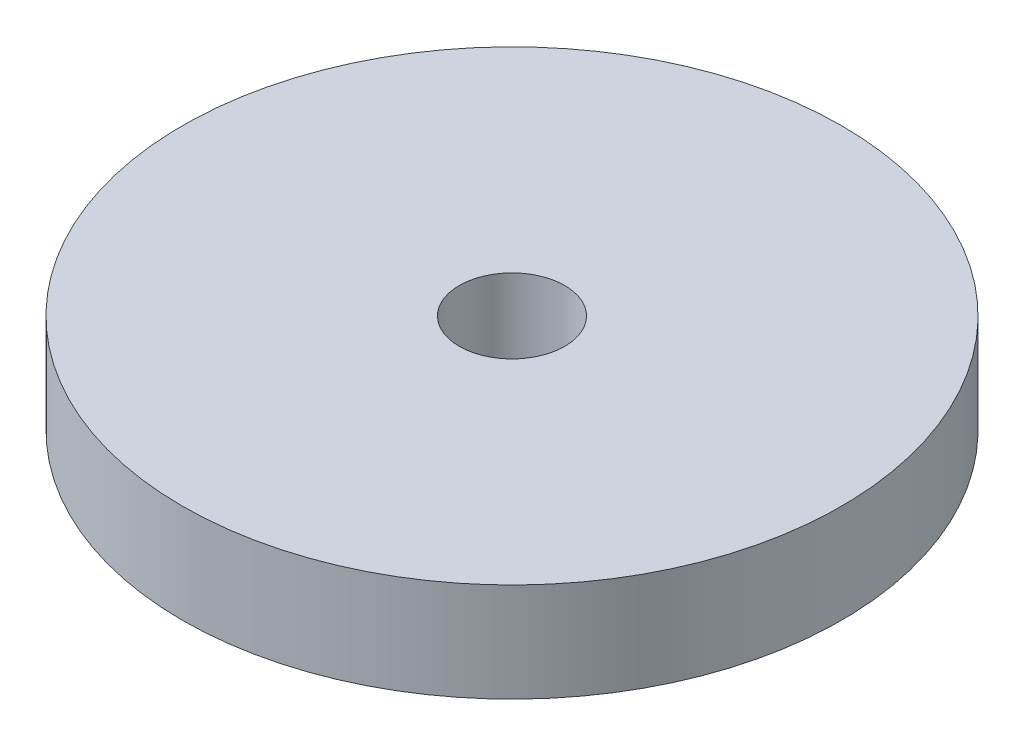
ISO-10303-21;
HEADER;
FILE_DESCRIPTION(('STEP AP214'),'2;1');
FILE_NAME('part.step','',(''),(''),'','','');
FILE_SCHEMA(('AUTOMOTIVE_DESIGN { 1 0 10303 214 1 1 1 1 }'));
ENDSEC;
DATA;
#1=APPLICATION_CONTEXT('core data for automotive mechanical design processes');
#2=APPLICATION_PROTOCOL_DEFINITION('international standard','automotive_design',2000,#1);
#3=PRODUCT_CONTEXT('',#1,'mechanical');
#4=PRODUCT('Part','Part','',(#3));
#5=PRODUCT_RELATED_PRODUCT_CATEGORY('part','',(#4));
#6=PRODUCT_DEFINITION_FORMATION('','',#4);
#7=PRODUCT_DEFINITION_CONTEXT('part definition',#1,'design');
#8=PRODUCT_DEFINITION('design','',#6,#7);
#9=PRODUCT_DEFINITION_SHAPE('','',#8);
#10=(LENGTH_UNIT() NAMED_UNIT(*) SI_UNIT(.MILLI.,.METRE.));
#11=(NAMED_UNIT(*) PLANE_ANGLE_UNIT() SI_UNIT($,.RADIAN.));
#12=(NAMED_UNIT(*) SI_UNIT($,.STERADIAN.) SOLID_ANGLE_UNIT());
#13=UNCERTAINTY_MEASURE_WITH_UNIT(LENGTH_MEASURE(1.E-05),#10,'distance_accuracy_value','');
#14=(GEOMETRIC_REPRESENTATION_CONTEXT(3) GLOBAL_UNCERTAINTY_ASSIGNED_CONTEXT((#13)) GLOBAL_UNIT_ASSIGNED_CONTEXT((#10,
#11,#12)) REPRESENTATION_CONTEXT('',''));
#15=CARTESIAN_POINT('',(0.,0.,0.));
#16=DIRECTION('',(0.,0.,1.));
#17=DIRECTION('',(1.,0.,0.));
#18=AXIS2_PLACEMENT_3D('',#15,#16,#17);
#19=CARTESIAN_POINT('',(0.,3.,0.));
#20=DIRECTION('',(0.,1.,0.));
#21=DIRECTION('',(0.,0.,1.));
#22=AXIS2_PLACEMENT_3D('',#19,#20,#21);
#23=PLANE('',#22);
#24=CARTESIAN_POINT('',(0.,3.,0.));
#25=DIRECTION('',(0.,1.,0.));
#26=DIRECTION('',(0.,0.,1.));
#27=AXIS2_PLACEMENT_3D('',#24,#25,#26);
#28=CIRCLE('',#27,10.);
#29=CARTESIAN_POINT('',(0.,3.,10.));
#30=VERTEX_POINT('',#29);
#31=EDGE_CURVE('E10',#30,#30,#28,.T.);
#32=ORIENTED_EDGE('',*,*,#31,.T.);
#33=EDGE_LOOP('',(#32));
#34=FACE_BOUND('',#33,.T.);
#35=CARTESIAN_POINT('',(0.,3.,0.));
#36=DIRECTION('',(0.,1.,0.));
#37=DIRECTION('',(0.,0.,1.));
#38=AXIS2_PLACEMENT_3D('',#35,#36,#37);
#39=CIRCLE('',#38,1.6);
#40=CARTESIAN_POINT('',(0.,3.,1.6));
#41=VERTEX_POINT('',#40);
#42=EDGE_CURVE('E56',#41,#41,#39,.T.);
#43=ORIENTED_EDGE('',*,*,#42,.F.);
#44=EDGE_LOOP('',(#43));
#45=FACE_BOUND('',#44,.T.);
#46=ADVANCED_FACE('F43',(#34,#45),#23,.T.);
#47=CARTESIAN_POINT('',(0.,0.,0.));
#48=DIRECTION('',(0.,1.,0.));
#49=DIRECTION('',(0.,0.,1.));
#50=AXIS2_PLACEMENT_3D('',#47,#48,#49);
#51=PLANE('',#50);
#52=CARTESIAN_POINT('',(0.,0.,0.));
#53=DIRECTION('',(0.,1.,0.));
#54=DIRECTION('',(0.,0.,1.));
#55=AXIS2_PLACEMENT_3D('',#52,#53,#54);
#56=CIRCLE('',#55,10.);
#57=CARTESIAN_POINT('',(0.,0.,10.));
#58=VERTEX_POINT('',#57);
#59=EDGE_CURVE('E47',#58,#58,#56,.T.);
#60=ORIENTED_EDGE('',*,*,#59,.F.);
#61=EDGE_LOOP('',(#60));
#62=FACE_BOUND('',#61,.T.);
#63=CARTESIAN_POINT('',(0.,0.,0.));
#64=DIRECTION('',(0.,1.,0.));
#65=DIRECTION('',(0.,0.,1.));
#66=AXIS2_PLACEMENT_3D('',#63,#64,#65);
#67=CIRCLE('',#66,1.6);
#68=CARTESIAN_POINT('',(0.,0.,1.6));
#69=VERTEX_POINT('',#68);
#70=EDGE_CURVE('E58',#69,#69,#67,.T.);
#71=ORIENTED_EDGE('',*,*,#70,.T.);
#72=EDGE_LOOP('',(#71));
#73=FACE_BOUND('',#72,.T.);
#74=ADVANCED_FACE('F70',(#62,#73),#51,.F.);
#75=CARTESIAN_POINT('',(0.,3.,0.));
#76=DIRECTION('',(0.,-1.,0.));
#77=DIRECTION('',(0.,0.,-1.));
#78=AXIS2_PLACEMENT_3D('',#75,#76,#77);
#79=CYLINDRICAL_SURFACE('',#78,10.);
#80=ORIENTED_EDGE('',*,*,#31,.F.);
#81=EDGE_LOOP('',(#80));
#82=FACE_BOUND('',#81,.T.);
#83=ORIENTED_EDGE('',*,*,#59,.T.);
#84=EDGE_LOOP('',(#83));
#85=FACE_BOUND('',#84,.T.);
#86=ADVANCED_FACE('F45',(#82,#85),#79,.T.);
#87=CARTESIAN_POINT('',(0.,3.,0.));
#88=DIRECTION('',(0.,-1.,0.));
#89=DIRECTION('',(0.,0.,-1.));
#90=AXIS2_PLACEMENT_3D('',#87,#88,#89);
#91=CYLINDRICAL_SURFACE('',#90,1.6);
#92=ORIENTED_EDGE('',*,*,#42,.T.);
#93=EDGE_LOOP('',(#92));
#94=FACE_BOUND('',#93,.T.);
#95=ORIENTED_EDGE('',*,*,#70,.F.);
#96=EDGE_LOOP('',(#95));
#97=FACE_BOUND('',#96,.T.);
#98=ADVANCED_FACE('F66',(#94,#97),#91,.F.);
#99=CLOSED_SHELL('',(#46,#74,#86,#98));
#100=MANIFOLD_SOLID_BREP('B2',#99);
#101=ADVANCED_BREP_SHAPE_REPRESENTATION('',(#18,#100),#14);
#102=SHAPE_DEFINITION_REPRESENTATION(#9,#101);
ENDSEC;
END-ISO-10303-21;
